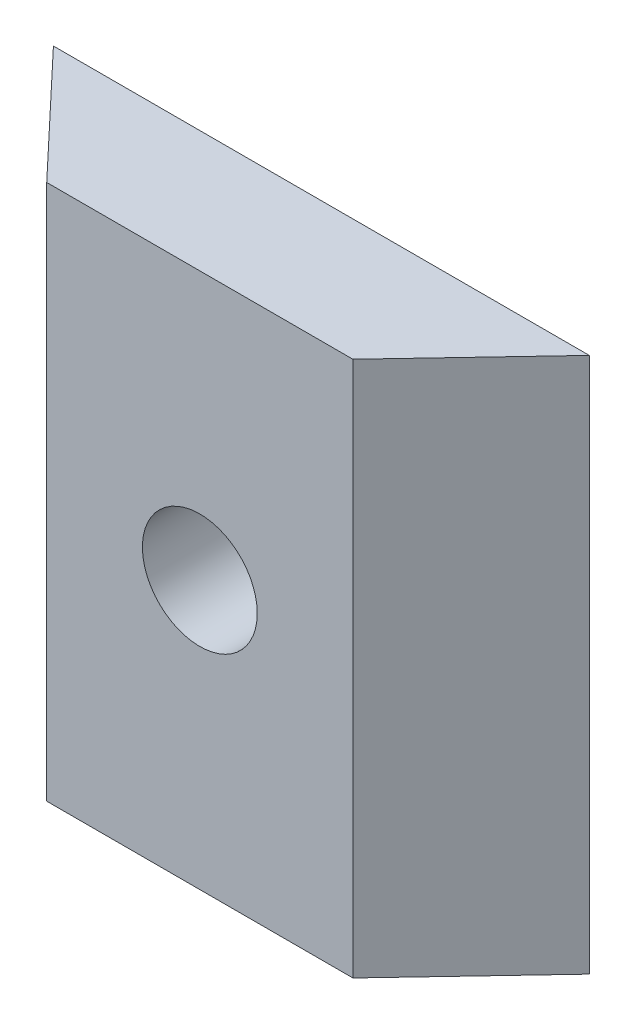
ISO-10303-21;
HEADER;
FILE_DESCRIPTION(('STEP AP214'),'2;1');
FILE_NAME('part.step','',(''),(''),'','','');
FILE_SCHEMA(('AUTOMOTIVE_DESIGN { 1 0 10303 214 1 1 1 1 }'));
ENDSEC;
DATA;
#1=APPLICATION_CONTEXT('core data for automotive mechanical design processes');
#2=APPLICATION_PROTOCOL_DEFINITION('international standard','automotive_design',2000,#1);
#3=PRODUCT_CONTEXT('',#1,'mechanical');
#4=PRODUCT('Part','Part','',(#3));
#5=PRODUCT_RELATED_PRODUCT_CATEGORY('part','',(#4));
#6=PRODUCT_DEFINITION_FORMATION('','',#4);
#7=PRODUCT_DEFINITION_CONTEXT('part definition',#1,'design');
#8=PRODUCT_DEFINITION('design','',#6,#7);
#9=PRODUCT_DEFINITION_SHAPE('','',#8);
#10=(LENGTH_UNIT() NAMED_UNIT(*) SI_UNIT(.MILLI.,.METRE.));
#11=(NAMED_UNIT(*) PLANE_ANGLE_UNIT() SI_UNIT($,.RADIAN.));
#12=(NAMED_UNIT(*) SI_UNIT($,.STERADIAN.) SOLID_ANGLE_UNIT());
#13=UNCERTAINTY_MEASURE_WITH_UNIT(LENGTH_MEASURE(1.E-05),#10,'distance_accuracy_value','');
#14=(GEOMETRIC_REPRESENTATION_CONTEXT(3) GLOBAL_UNCERTAINTY_ASSIGNED_CONTEXT((#13)) GLOBAL_UNIT_ASSIGNED_CONTEXT((#10,
#11,#12)) REPRESENTATION_CONTEXT('',''));
#15=CARTESIAN_POINT('',(0.,0.,0.));
#16=DIRECTION('',(0.,0.,1.));
#17=DIRECTION('',(1.,0.,0.));
#18=AXIS2_PLACEMENT_3D('',#15,#16,#17);
#19=CARTESIAN_POINT('',(-7.,7.,3.175));
#20=DIRECTION('',(0.,-1.,0.));
#21=DIRECTION('',(0.,0.,-1.));
#22=AXIS2_PLACEMENT_3D('',#19,#20,#21);
#23=PLANE('',#22);
#24=DIRECTION('',(-1.,0.,0.));
#25=VECTOR('',#24,1.);
#26=CARTESIAN_POINT('',(-7.,7.,3.175));
#27=LINE('',#26,#25);
#28=CARTESIAN_POINT('',(4.,7.,3.175));
#29=VERTEX_POINT('',#28);
#30=CARTESIAN_POINT('',(-4.,7.,3.175));
#31=VERTEX_POINT('',#30);
#32=EDGE_CURVE('E43',#29,#31,#27,.T.);
#33=ORIENTED_EDGE('',*,*,#32,.F.);
#34=DIRECTION('',(0.686791571283882,0.,-0.726854412942108));
#35=VECTOR('',#34,1.);
#36=CARTESIAN_POINT('',(7.,7.,0.));
#37=LINE('',#36,#35);
#38=CARTESIAN_POINT('',(7.,7.,0.));
#39=VERTEX_POINT('',#38);
#40=EDGE_CURVE('E79',#29,#39,#37,.T.);
#41=ORIENTED_EDGE('',*,*,#40,.T.);
#42=DIRECTION('',(-1.,0.,0.));
#43=VECTOR('',#42,1.);
#44=CARTESIAN_POINT('',(-7.,7.,0.));
#45=LINE('',#44,#43);
#46=CARTESIAN_POINT('',(-7.,7.,0.));
#47=VERTEX_POINT('',#46);
#48=EDGE_CURVE('E84',#39,#47,#45,.T.);
#49=ORIENTED_EDGE('',*,*,#48,.T.);
#50=DIRECTION('',(0.686791571283882,0.,0.726854412942108));
#51=VECTOR('',#50,1.);
#52=CARTESIAN_POINT('',(-7.,7.,0.));
#53=LINE('',#52,#51);
#54=EDGE_CURVE('E59',#47,#31,#53,.T.);
#55=ORIENTED_EDGE('',*,*,#54,.T.);
#56=EDGE_LOOP('',(#33,#41,#49,#55));
#57=FACE_BOUND('',#56,.T.);
#58=ADVANCED_FACE('F35',(#57),#23,.F.);
#59=CARTESIAN_POINT('',(-7.,-7.,3.175));
#60=DIRECTION('',(0.,1.,0.));
#61=DIRECTION('',(0.,0.,1.));
#62=AXIS2_PLACEMENT_3D('',#59,#60,#61);
#63=PLANE('',#62);
#64=DIRECTION('',(1.,0.,0.));
#65=VECTOR('',#64,1.);
#66=CARTESIAN_POINT('',(-7.,-7.,0.));
#67=LINE('',#66,#65);
#68=CARTESIAN_POINT('',(-7.,-7.,0.));
#69=VERTEX_POINT('',#68);
#70=CARTESIAN_POINT('',(7.,-7.,0.));
#71=VERTEX_POINT('',#70);
#72=EDGE_CURVE('E38',#69,#71,#67,.T.);
#73=ORIENTED_EDGE('',*,*,#72,.T.);
#74=DIRECTION('',(0.686791571283882,0.,-0.726854412942108));
#75=VECTOR('',#74,1.);
#76=CARTESIAN_POINT('',(7.,-7.,0.));
#77=LINE('',#76,#75);
#78=CARTESIAN_POINT('',(4.,-7.,3.175));
#79=VERTEX_POINT('',#78);
#80=EDGE_CURVE('E51',#79,#71,#77,.T.);
#81=ORIENTED_EDGE('',*,*,#80,.F.);
#82=DIRECTION('',(1.,0.,0.));
#83=VECTOR('',#82,1.);
#84=CARTESIAN_POINT('',(-7.,-7.,3.175));
#85=LINE('',#84,#83);
#86=CARTESIAN_POINT('',(-4.,-7.,3.175));
#87=VERTEX_POINT('',#86);
#88=EDGE_CURVE('E11',#87,#79,#85,.T.);
#89=ORIENTED_EDGE('',*,*,#88,.F.);
#90=DIRECTION('',(0.686791571283882,0.,0.726854412942108));
#91=VECTOR('',#90,1.);
#92=CARTESIAN_POINT('',(-7.,-7.,0.));
#93=LINE('',#92,#91);
#94=EDGE_CURVE('E99',#69,#87,#93,.T.);
#95=ORIENTED_EDGE('',*,*,#94,.F.);
#96=EDGE_LOOP('',(#73,#81,#89,#95));
#97=FACE_BOUND('',#96,.T.);
#98=ADVANCED_FACE('F121',(#97),#63,.F.);
#99=CARTESIAN_POINT('',(0.,0.,3.175));
#100=DIRECTION('',(0.,0.,1.));
#101=DIRECTION('',(1.,0.,0.));
#102=AXIS2_PLACEMENT_3D('',#99,#100,#101);
#103=PLANE('',#102);
#104=CARTESIAN_POINT('',(0.,0.,3.175));
#105=DIRECTION('',(0.,0.,1.));
#106=DIRECTION('',(1.,0.,0.));
#107=AXIS2_PLACEMENT_3D('',#104,#105,#106);
#108=CIRCLE('',#107,1.5);
#109=CARTESIAN_POINT('',(1.5,0.,3.175));
#110=VERTEX_POINT('',#109);
#111=EDGE_CURVE('E105',#110,#110,#108,.T.);
#112=ORIENTED_EDGE('',*,*,#111,.F.);
#113=EDGE_LOOP('',(#112));
#114=FACE_BOUND('',#113,.T.);
#115=DIRECTION('',(0.,-1.,0.));
#116=VECTOR('',#115,1.);
#117=CARTESIAN_POINT('',(4.,7.,3.175));
#118=LINE('',#117,#116);
#119=EDGE_CURVE('E90',#29,#79,#118,.T.);
#120=ORIENTED_EDGE('',*,*,#119,.F.);
#121=ORIENTED_EDGE('',*,*,#32,.T.);
#122=DIRECTION('',(0.,-1.,0.));
#123=VECTOR('',#122,1.);
#124=CARTESIAN_POINT('',(-4.,7.,3.175));
#125=LINE('',#124,#123);
#126=EDGE_CURVE('E85',#31,#87,#125,.T.);
#127=ORIENTED_EDGE('',*,*,#126,.T.);
#128=ORIENTED_EDGE('',*,*,#88,.T.);
#129=EDGE_LOOP('',(#120,#121,#127,#128));
#130=FACE_BOUND('',#129,.T.);
#131=ADVANCED_FACE('F118',(#114,#130),#103,.T.);
#132=CARTESIAN_POINT('',(0.,0.,0.));
#133=DIRECTION('',(0.,0.,1.));
#134=DIRECTION('',(1.,0.,0.));
#135=AXIS2_PLACEMENT_3D('',#132,#133,#134);
#136=PLANE('',#135);
#137=CARTESIAN_POINT('',(0.,0.,0.));
#138=DIRECTION('',(0.,0.,1.));
#139=DIRECTION('',(1.,0.,0.));
#140=AXIS2_PLACEMENT_3D('',#137,#138,#139);
#141=CIRCLE('',#140,1.5);
#142=CARTESIAN_POINT('',(1.5,0.,0.));
#143=VERTEX_POINT('',#142);
#144=EDGE_CURVE('E103',#143,#143,#141,.T.);
#145=ORIENTED_EDGE('',*,*,#144,.T.);
#146=EDGE_LOOP('',(#145));
#147=FACE_BOUND('',#146,.T.);
#148=DIRECTION('',(0.,1.,0.));
#149=VECTOR('',#148,1.);
#150=CARTESIAN_POINT('',(7.,7.,0.));
#151=LINE('',#150,#149);
#152=EDGE_CURVE('E76',#71,#39,#151,.T.);
#153=ORIENTED_EDGE('',*,*,#152,.F.);
#154=ORIENTED_EDGE('',*,*,#72,.F.);
#155=DIRECTION('',(0.,-1.,0.));
#156=VECTOR('',#155,1.);
#157=CARTESIAN_POINT('',(-7.,7.,0.));
#158=LINE('',#157,#156);
#159=EDGE_CURVE('E93',#47,#69,#158,.T.);
#160=ORIENTED_EDGE('',*,*,#159,.F.);
#161=ORIENTED_EDGE('',*,*,#48,.F.);
#162=EDGE_LOOP('',(#153,#154,#160,#161));
#163=FACE_BOUND('',#162,.T.);
#164=ADVANCED_FACE('F92',(#147,#163),#136,.F.);
#165=CARTESIAN_POINT('',(-7.,7.,0.));
#166=DIRECTION('',(0.726854412942108,0.,-0.686791571283882));
#167=DIRECTION('',(-0.686791571283882,0.,-0.726854412942108));
#168=AXIS2_PLACEMENT_3D('',#165,#166,#167);
#169=PLANE('',#168);
#170=ORIENTED_EDGE('',*,*,#94,.T.);
#171=ORIENTED_EDGE('',*,*,#126,.F.);
#172=ORIENTED_EDGE('',*,*,#54,.F.);
#173=ORIENTED_EDGE('',*,*,#159,.T.);
#174=EDGE_LOOP('',(#170,#171,#172,#173));
#175=FACE_BOUND('',#174,.T.);
#176=ADVANCED_FACE('F126',(#175),#169,.F.);
#177=CARTESIAN_POINT('',(7.,7.,0.));
#178=DIRECTION('',(-0.726854412942108,0.,-0.686791571283882));
#179=DIRECTION('',(-0.686791571283882,0.,0.726854412942108));
#180=AXIS2_PLACEMENT_3D('',#177,#178,#179);
#181=PLANE('',#180);
#182=ORIENTED_EDGE('',*,*,#80,.T.);
#183=ORIENTED_EDGE('',*,*,#152,.T.);
#184=ORIENTED_EDGE('',*,*,#40,.F.);
#185=ORIENTED_EDGE('',*,*,#119,.T.);
#186=EDGE_LOOP('',(#182,#183,#184,#185));
#187=FACE_BOUND('',#186,.T.);
#188=ADVANCED_FACE('F78',(#187),#181,.F.);
#189=CARTESIAN_POINT('',(0.,0.,0.));
#190=DIRECTION('',(0.,0.,1.));
#191=DIRECTION('',(1.,0.,0.));
#192=AXIS2_PLACEMENT_3D('',#189,#190,#191);
#193=CYLINDRICAL_SURFACE('',#192,1.5);
#194=ORIENTED_EDGE('',*,*,#144,.F.);
#195=EDGE_LOOP('',(#194));
#196=FACE_BOUND('',#195,.T.);
#197=ORIENTED_EDGE('',*,*,#111,.T.);
#198=EDGE_LOOP('',(#197));
#199=FACE_BOUND('',#198,.T.);
#200=ADVANCED_FACE('F112',(#196,#199),#193,.F.);
#201=CLOSED_SHELL('',(#58,#98,#131,#164,#176,#188,#200));
#202=MANIFOLD_SOLID_BREP('B2',#201);
#203=ADVANCED_BREP_SHAPE_REPRESENTATION('',(#18,#202),#14);
#204=SHAPE_DEFINITION_REPRESENTATION(#9,#203);
ENDSEC;
END-ISO-10303-21;
